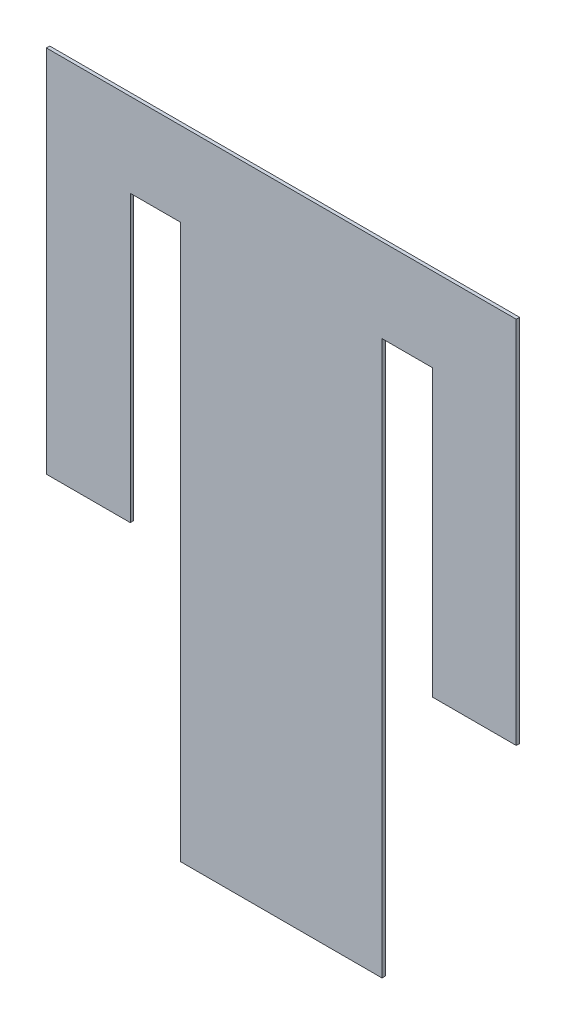
ISO-10303-21;
HEADER;
FILE_DESCRIPTION(('STEP AP214'),'2;1');
FILE_NAME('part.step','',(''),(''),'','','');
FILE_SCHEMA(('AUTOMOTIVE_DESIGN { 1 0 10303 214 1 1 1 1 }'));
ENDSEC;
DATA;
#1=APPLICATION_CONTEXT('core data for automotive mechanical design processes');
#2=APPLICATION_PROTOCOL_DEFINITION('international standard','automotive_design',2000,#1);
#3=PRODUCT_CONTEXT('',#1,'mechanical');
#4=PRODUCT('Part','Part','',(#3));
#5=PRODUCT_RELATED_PRODUCT_CATEGORY('part','',(#4));
#6=PRODUCT_DEFINITION_FORMATION('','',#4);
#7=PRODUCT_DEFINITION_CONTEXT('part definition',#1,'design');
#8=PRODUCT_DEFINITION('design','',#6,#7);
#9=PRODUCT_DEFINITION_SHAPE('','',#8);
#10=(LENGTH_UNIT() NAMED_UNIT(*) SI_UNIT(.MILLI.,.METRE.));
#11=(NAMED_UNIT(*) PLANE_ANGLE_UNIT() SI_UNIT($,.RADIAN.));
#12=(NAMED_UNIT(*) SI_UNIT($,.STERADIAN.) SOLID_ANGLE_UNIT());
#13=UNCERTAINTY_MEASURE_WITH_UNIT(LENGTH_MEASURE(1.E-05),#10,'distance_accuracy_value','');
#14=(GEOMETRIC_REPRESENTATION_CONTEXT(3) GLOBAL_UNCERTAINTY_ASSIGNED_CONTEXT((#13)) GLOBAL_UNIT_ASSIGNED_CONTEXT((#10,
#11,#12)) REPRESENTATION_CONTEXT('',''));
#15=CARTESIAN_POINT('',(0.,0.,0.));
#16=DIRECTION('',(0.,0.,1.));
#17=DIRECTION('',(1.,0.,0.));
#18=AXIS2_PLACEMENT_3D('',#15,#16,#17);
#19=CARTESIAN_POINT('',(50.,0.,2.));
#20=DIRECTION('',(0.,1.,0.));
#21=DIRECTION('',(-1.,0.,0.));
#22=AXIS2_PLACEMENT_3D('',#19,#20,#21);
#23=PLANE('',#22);
#24=DIRECTION('',(1.,0.,0.));
#25=VECTOR('',#24,1.);
#26=CARTESIAN_POINT('',(50.,0.,0.));
#27=LINE('',#26,#25);
#28=CARTESIAN_POINT('',(0.,0.,0.));
#29=VERTEX_POINT('',#28);
#30=CARTESIAN_POINT('',(50.,0.,0.));
#31=VERTEX_POINT('',#30);
#32=EDGE_CURVE('E164',#29,#31,#27,.T.);
#33=ORIENTED_EDGE('',*,*,#32,.T.);
#34=DIRECTION('',(0.,0.,-1.));
#35=VECTOR('',#34,1.);
#36=CARTESIAN_POINT('',(50.,0.,2.));
#37=LINE('',#36,#35);
#38=CARTESIAN_POINT('',(50.,0.,2.));
#39=VERTEX_POINT('',#38);
#40=EDGE_CURVE('E11',#39,#31,#37,.T.);
#41=ORIENTED_EDGE('',*,*,#40,.F.);
#42=DIRECTION('',(1.,0.,0.));
#43=VECTOR('',#42,1.);
#44=CARTESIAN_POINT('',(50.,0.,2.));
#45=LINE('',#44,#43);
#46=CARTESIAN_POINT('',(0.,0.,2.));
#47=VERTEX_POINT('',#46);
#48=EDGE_CURVE('E198',#47,#39,#45,.T.);
#49=ORIENTED_EDGE('',*,*,#48,.F.);
#50=DIRECTION('',(0.,0.,-1.));
#51=VECTOR('',#50,1.);
#52=CARTESIAN_POINT('',(0.,0.,2.));
#53=LINE('',#52,#51);
#54=EDGE_CURVE('E160',#47,#29,#53,.T.);
#55=ORIENTED_EDGE('',*,*,#54,.T.);
#56=EDGE_LOOP('',(#33,#41,#49,#55));
#57=FACE_BOUND('',#56,.T.);
#58=ADVANCED_FACE('F39',(#57),#23,.F.);
#59=CARTESIAN_POINT('',(50.,170.,2.));
#60=DIRECTION('',(-1.,0.,0.));
#61=DIRECTION('',(0.,-1.,0.));
#62=AXIS2_PLACEMENT_3D('',#59,#60,#61);
#63=PLANE('',#62);
#64=DIRECTION('',(0.,1.,0.));
#65=VECTOR('',#64,1.);
#66=CARTESIAN_POINT('',(50.,170.,0.));
#67=LINE('',#66,#65);
#68=CARTESIAN_POINT('',(50.,170.,0.));
#69=VERTEX_POINT('',#68);
#70=EDGE_CURVE('E168',#31,#69,#67,.T.);
#71=ORIENTED_EDGE('',*,*,#70,.T.);
#72=DIRECTION('',(0.,0.,-1.));
#73=VECTOR('',#72,1.);
#74=CARTESIAN_POINT('',(50.,170.,2.));
#75=LINE('',#74,#73);
#76=CARTESIAN_POINT('',(50.,170.,2.));
#77=VERTEX_POINT('',#76);
#78=EDGE_CURVE('E48',#77,#69,#75,.T.);
#79=ORIENTED_EDGE('',*,*,#78,.F.);
#80=DIRECTION('',(0.,1.,0.));
#81=VECTOR('',#80,1.);
#82=CARTESIAN_POINT('',(50.,170.,2.));
#83=LINE('',#82,#81);
#84=EDGE_CURVE('E111',#39,#77,#83,.T.);
#85=ORIENTED_EDGE('',*,*,#84,.F.);
#86=ORIENTED_EDGE('',*,*,#40,.T.);
#87=EDGE_LOOP('',(#71,#79,#85,#86));
#88=FACE_BOUND('',#87,.T.);
#89=ADVANCED_FACE('F292',(#88),#63,.F.);
#90=CARTESIAN_POINT('',(80.,170.,2.));
#91=DIRECTION('',(0.,1.,0.));
#92=DIRECTION('',(0.,0.,1.));
#93=AXIS2_PLACEMENT_3D('',#90,#91,#92);
#94=PLANE('',#93);
#95=DIRECTION('',(1.,0.,0.));
#96=VECTOR('',#95,1.);
#97=CARTESIAN_POINT('',(80.,170.,0.));
#98=LINE('',#97,#96);
#99=CARTESIAN_POINT('',(80.,170.,0.));
#100=VERTEX_POINT('',#99);
#101=EDGE_CURVE('E171',#69,#100,#98,.T.);
#102=ORIENTED_EDGE('',*,*,#101,.T.);
#103=DIRECTION('',(0.,0.,-1.));
#104=VECTOR('',#103,1.);
#105=CARTESIAN_POINT('',(80.,170.,2.));
#106=LINE('',#105,#104);
#107=CARTESIAN_POINT('',(80.,170.,2.));
#108=VERTEX_POINT('',#107);
#109=EDGE_CURVE('E225',#108,#100,#106,.T.);
#110=ORIENTED_EDGE('',*,*,#109,.F.);
#111=DIRECTION('',(1.,0.,0.));
#112=VECTOR('',#111,1.);
#113=CARTESIAN_POINT('',(80.,170.,2.));
#114=LINE('',#113,#112);
#115=EDGE_CURVE('E235',#77,#108,#114,.T.);
#116=ORIENTED_EDGE('',*,*,#115,.F.);
#117=ORIENTED_EDGE('',*,*,#78,.T.);
#118=EDGE_LOOP('',(#102,#110,#116,#117));
#119=FACE_BOUND('',#118,.T.);
#120=ADVANCED_FACE('F233',(#119),#94,.F.);
#121=CARTESIAN_POINT('',(80.,-160.,2.));
#122=DIRECTION('',(1.,0.,0.));
#123=DIRECTION('',(0.,0.,-1.));
#124=AXIS2_PLACEMENT_3D('',#121,#122,#123);
#125=PLANE('',#124);
#126=DIRECTION('',(0.,-1.,0.));
#127=VECTOR('',#126,1.);
#128=CARTESIAN_POINT('',(80.,-160.,0.));
#129=LINE('',#128,#127);
#130=CARTESIAN_POINT('',(80.,-160.,0.));
#131=VERTEX_POINT('',#130);
#132=EDGE_CURVE('E174',#100,#131,#129,.T.);
#133=ORIENTED_EDGE('',*,*,#132,.T.);
#134=DIRECTION('',(0.,0.,-1.));
#135=VECTOR('',#134,1.);
#136=CARTESIAN_POINT('',(80.,-160.,2.));
#137=LINE('',#136,#135);
#138=CARTESIAN_POINT('',(80.,-160.,2.));
#139=VERTEX_POINT('',#138);
#140=EDGE_CURVE('E221',#139,#131,#137,.T.);
#141=ORIENTED_EDGE('',*,*,#140,.F.);
#142=DIRECTION('',(0.,-1.,0.));
#143=VECTOR('',#142,1.);
#144=CARTESIAN_POINT('',(80.,-160.,2.));
#145=LINE('',#144,#143);
#146=EDGE_CURVE('E254',#108,#139,#145,.T.);
#147=ORIENTED_EDGE('',*,*,#146,.F.);
#148=ORIENTED_EDGE('',*,*,#109,.T.);
#149=EDGE_LOOP('',(#133,#141,#147,#148));
#150=FACE_BOUND('',#149,.T.);
#151=ADVANCED_FACE('F244',(#150),#125,.F.);
#152=CARTESIAN_POINT('',(200.,-160.,2.));
#153=DIRECTION('',(0.,1.,0.));
#154=DIRECTION('',(-1.,0.,0.));
#155=AXIS2_PLACEMENT_3D('',#152,#153,#154);
#156=PLANE('',#155);
#157=DIRECTION('',(1.,0.,0.));
#158=VECTOR('',#157,1.);
#159=CARTESIAN_POINT('',(200.,-160.,0.));
#160=LINE('',#159,#158);
#161=CARTESIAN_POINT('',(200.,-160.,0.));
#162=VERTEX_POINT('',#161);
#163=EDGE_CURVE('E177',#131,#162,#160,.T.);
#164=ORIENTED_EDGE('',*,*,#163,.T.);
#165=DIRECTION('',(0.,0.,-1.));
#166=VECTOR('',#165,1.);
#167=CARTESIAN_POINT('',(200.,-160.,2.));
#168=LINE('',#167,#166);
#169=CARTESIAN_POINT('',(200.,-160.,2.));
#170=VERTEX_POINT('',#169);
#171=EDGE_CURVE('E217',#170,#162,#168,.T.);
#172=ORIENTED_EDGE('',*,*,#171,.F.);
#173=DIRECTION('',(1.,0.,0.));
#174=VECTOR('',#173,1.);
#175=CARTESIAN_POINT('',(200.,-160.,2.));
#176=LINE('',#175,#174);
#177=EDGE_CURVE('E250',#139,#170,#176,.T.);
#178=ORIENTED_EDGE('',*,*,#177,.F.);
#179=ORIENTED_EDGE('',*,*,#140,.T.);
#180=EDGE_LOOP('',(#164,#172,#178,#179));
#181=FACE_BOUND('',#180,.T.);
#182=ADVANCED_FACE('F248',(#181),#156,.F.);
#183=CARTESIAN_POINT('',(200.,170.,2.));
#184=DIRECTION('',(-1.,0.,0.));
#185=DIRECTION('',(0.,-1.,0.));
#186=AXIS2_PLACEMENT_3D('',#183,#184,#185);
#187=PLANE('',#186);
#188=DIRECTION('',(0.,1.,0.));
#189=VECTOR('',#188,1.);
#190=CARTESIAN_POINT('',(200.,170.,0.));
#191=LINE('',#190,#189);
#192=CARTESIAN_POINT('',(200.,170.,0.));
#193=VERTEX_POINT('',#192);
#194=EDGE_CURVE('E180',#162,#193,#191,.T.);
#195=ORIENTED_EDGE('',*,*,#194,.T.);
#196=DIRECTION('',(0.,0.,-1.));
#197=VECTOR('',#196,1.);
#198=CARTESIAN_POINT('',(200.,170.,2.));
#199=LINE('',#198,#197);
#200=CARTESIAN_POINT('',(200.,170.,2.));
#201=VERTEX_POINT('',#200);
#202=EDGE_CURVE('E213',#201,#193,#199,.T.);
#203=ORIENTED_EDGE('',*,*,#202,.F.);
#204=DIRECTION('',(0.,1.,0.));
#205=VECTOR('',#204,1.);
#206=CARTESIAN_POINT('',(200.,170.,2.));
#207=LINE('',#206,#205);
#208=EDGE_CURVE('E253',#170,#201,#207,.T.);
#209=ORIENTED_EDGE('',*,*,#208,.F.);
#210=ORIENTED_EDGE('',*,*,#171,.T.);
#211=EDGE_LOOP('',(#195,#203,#209,#210));
#212=FACE_BOUND('',#211,.T.);
#213=ADVANCED_FACE('F305',(#212),#187,.F.);
#214=CARTESIAN_POINT('',(230.,170.,2.));
#215=DIRECTION('',(0.,1.,0.));
#216=DIRECTION('',(0.,0.,1.));
#217=AXIS2_PLACEMENT_3D('',#214,#215,#216);
#218=PLANE('',#217);
#219=DIRECTION('',(1.,0.,0.));
#220=VECTOR('',#219,1.);
#221=CARTESIAN_POINT('',(230.,170.,0.));
#222=LINE('',#221,#220);
#223=CARTESIAN_POINT('',(230.,170.,0.));
#224=VERTEX_POINT('',#223);
#225=EDGE_CURVE('E183',#193,#224,#222,.T.);
#226=ORIENTED_EDGE('',*,*,#225,.T.);
#227=DIRECTION('',(0.,0.,-1.));
#228=VECTOR('',#227,1.);
#229=CARTESIAN_POINT('',(230.,170.,2.));
#230=LINE('',#229,#228);
#231=CARTESIAN_POINT('',(230.,170.,2.));
#232=VERTEX_POINT('',#231);
#233=EDGE_CURVE('E209',#232,#224,#230,.T.);
#234=ORIENTED_EDGE('',*,*,#233,.F.);
#235=DIRECTION('',(1.,0.,0.));
#236=VECTOR('',#235,1.);
#237=CARTESIAN_POINT('',(230.,170.,2.));
#238=LINE('',#237,#236);
#239=EDGE_CURVE('E258',#201,#232,#238,.T.);
#240=ORIENTED_EDGE('',*,*,#239,.F.);
#241=ORIENTED_EDGE('',*,*,#202,.T.);
#242=EDGE_LOOP('',(#226,#234,#240,#241));
#243=FACE_BOUND('',#242,.T.);
#244=ADVANCED_FACE('F308',(#243),#218,.F.);
#245=CARTESIAN_POINT('',(230.,0.,2.));
#246=DIRECTION('',(1.,0.,0.));
#247=DIRECTION('',(0.,0.,-1.));
#248=AXIS2_PLACEMENT_3D('',#245,#246,#247);
#249=PLANE('',#248);
#250=DIRECTION('',(0.,-1.,0.));
#251=VECTOR('',#250,1.);
#252=CARTESIAN_POINT('',(230.,0.,0.));
#253=LINE('',#252,#251);
#254=CARTESIAN_POINT('',(230.,0.,0.));
#255=VERTEX_POINT('',#254);
#256=EDGE_CURVE('E186',#224,#255,#253,.T.);
#257=ORIENTED_EDGE('',*,*,#256,.T.);
#258=DIRECTION('',(0.,0.,-1.));
#259=VECTOR('',#258,1.);
#260=CARTESIAN_POINT('',(230.,0.,2.));
#261=LINE('',#260,#259);
#262=CARTESIAN_POINT('',(230.,0.,2.));
#263=VERTEX_POINT('',#262);
#264=EDGE_CURVE('E205',#263,#255,#261,.T.);
#265=ORIENTED_EDGE('',*,*,#264,.F.);
#266=DIRECTION('',(0.,-1.,0.));
#267=VECTOR('',#266,1.);
#268=CARTESIAN_POINT('',(230.,0.,2.));
#269=LINE('',#268,#267);
#270=EDGE_CURVE('E265',#232,#263,#269,.T.);
#271=ORIENTED_EDGE('',*,*,#270,.F.);
#272=ORIENTED_EDGE('',*,*,#233,.T.);
#273=EDGE_LOOP('',(#257,#265,#271,#272));
#274=FACE_BOUND('',#273,.T.);
#275=ADVANCED_FACE('F273',(#274),#249,.F.);
#276=CARTESIAN_POINT('',(280.,0.,2.));
#277=DIRECTION('',(0.,1.,0.));
#278=DIRECTION('',(-1.,0.,0.));
#279=AXIS2_PLACEMENT_3D('',#276,#277,#278);
#280=PLANE('',#279);
#281=DIRECTION('',(1.,0.,0.));
#282=VECTOR('',#281,1.);
#283=CARTESIAN_POINT('',(280.,0.,0.));
#284=LINE('',#283,#282);
#285=CARTESIAN_POINT('',(280.,0.,0.));
#286=VERTEX_POINT('',#285);
#287=EDGE_CURVE('E189',#255,#286,#284,.T.);
#288=ORIENTED_EDGE('',*,*,#287,.T.);
#289=DIRECTION('',(0.,0.,-1.));
#290=VECTOR('',#289,1.);
#291=CARTESIAN_POINT('',(280.,0.,2.));
#292=LINE('',#291,#290);
#293=CARTESIAN_POINT('',(280.,0.,2.));
#294=VERTEX_POINT('',#293);
#295=EDGE_CURVE('E153',#294,#286,#292,.T.);
#296=ORIENTED_EDGE('',*,*,#295,.F.);
#297=DIRECTION('',(1.,0.,0.));
#298=VECTOR('',#297,1.);
#299=CARTESIAN_POINT('',(280.,0.,2.));
#300=LINE('',#299,#298);
#301=EDGE_CURVE('E142',#263,#294,#300,.T.);
#302=ORIENTED_EDGE('',*,*,#301,.F.);
#303=ORIENTED_EDGE('',*,*,#264,.T.);
#304=EDGE_LOOP('',(#288,#296,#302,#303));
#305=FACE_BOUND('',#304,.T.);
#306=ADVANCED_FACE('F277',(#305),#280,.F.);
#307=CARTESIAN_POINT('',(280.,220.,2.));
#308=DIRECTION('',(-1.,0.,0.));
#309=DIRECTION('',(0.,0.,1.));
#310=AXIS2_PLACEMENT_3D('',#307,#308,#309);
#311=PLANE('',#310);
#312=DIRECTION('',(0.,1.,0.));
#313=VECTOR('',#312,1.);
#314=CARTESIAN_POINT('',(280.,220.,0.));
#315=LINE('',#314,#313);
#316=CARTESIAN_POINT('',(280.,220.,0.));
#317=VERTEX_POINT('',#316);
#318=EDGE_CURVE('E151',#286,#317,#315,.T.);
#319=ORIENTED_EDGE('',*,*,#318,.T.);
#320=DIRECTION('',(0.,0.,-1.));
#321=VECTOR('',#320,1.);
#322=CARTESIAN_POINT('',(280.,220.,2.));
#323=LINE('',#322,#321);
#324=CARTESIAN_POINT('',(280.,220.,2.));
#325=VERTEX_POINT('',#324);
#326=EDGE_CURVE('E148',#325,#317,#323,.T.);
#327=ORIENTED_EDGE('',*,*,#326,.F.);
#328=DIRECTION('',(0.,1.,0.));
#329=VECTOR('',#328,1.);
#330=CARTESIAN_POINT('',(280.,220.,2.));
#331=LINE('',#330,#329);
#332=EDGE_CURVE('E136',#294,#325,#331,.T.);
#333=ORIENTED_EDGE('',*,*,#332,.F.);
#334=ORIENTED_EDGE('',*,*,#295,.T.);
#335=EDGE_LOOP('',(#319,#327,#333,#334));
#336=FACE_BOUND('',#335,.T.);
#337=ADVANCED_FACE('F149',(#336),#311,.F.);
#338=CARTESIAN_POINT('',(0.,220.,2.));
#339=DIRECTION('',(0.,-1.,0.));
#340=DIRECTION('',(1.,0.,0.));
#341=AXIS2_PLACEMENT_3D('',#338,#339,#340);
#342=PLANE('',#341);
#343=DIRECTION('',(-1.,0.,0.));
#344=VECTOR('',#343,1.);
#345=CARTESIAN_POINT('',(0.,220.,0.));
#346=LINE('',#345,#344);
#347=CARTESIAN_POINT('',(0.,220.,0.));
#348=VERTEX_POINT('',#347);
#349=EDGE_CURVE('E97',#317,#348,#346,.T.);
#350=ORIENTED_EDGE('',*,*,#349,.T.);
#351=DIRECTION('',(0.,0.,-1.));
#352=VECTOR('',#351,1.);
#353=CARTESIAN_POINT('',(0.,220.,2.));
#354=LINE('',#353,#352);
#355=CARTESIAN_POINT('',(0.,220.,2.));
#356=VERTEX_POINT('',#355);
#357=EDGE_CURVE('E154',#356,#348,#354,.T.);
#358=ORIENTED_EDGE('',*,*,#357,.F.);
#359=DIRECTION('',(-1.,0.,0.));
#360=VECTOR('',#359,1.);
#361=CARTESIAN_POINT('',(0.,220.,2.));
#362=LINE('',#361,#360);
#363=EDGE_CURVE('E140',#325,#356,#362,.T.);
#364=ORIENTED_EDGE('',*,*,#363,.F.);
#365=ORIENTED_EDGE('',*,*,#326,.T.);
#366=EDGE_LOOP('',(#350,#358,#364,#365));
#367=FACE_BOUND('',#366,.T.);
#368=ADVANCED_FACE('F156',(#367),#342,.F.);
#369=CARTESIAN_POINT('',(0.,0.,2.));
#370=DIRECTION('',(1.,0.,0.));
#371=DIRECTION('',(0.,0.,-1.));
#372=AXIS2_PLACEMENT_3D('',#369,#370,#371);
#373=PLANE('',#372);
#374=DIRECTION('',(0.,-1.,0.));
#375=VECTOR('',#374,1.);
#376=CARTESIAN_POINT('',(0.,0.,0.));
#377=LINE('',#376,#375);
#378=EDGE_CURVE('E103',#348,#29,#377,.T.);
#379=ORIENTED_EDGE('',*,*,#378,.T.);
#380=ORIENTED_EDGE('',*,*,#54,.F.);
#381=DIRECTION('',(0.,-1.,0.));
#382=VECTOR('',#381,1.);
#383=CARTESIAN_POINT('',(0.,0.,2.));
#384=LINE('',#383,#382);
#385=EDGE_CURVE('E56',#356,#47,#384,.T.);
#386=ORIENTED_EDGE('',*,*,#385,.F.);
#387=ORIENTED_EDGE('',*,*,#357,.T.);
#388=EDGE_LOOP('',(#379,#380,#386,#387));
#389=FACE_BOUND('',#388,.T.);
#390=ADVANCED_FACE('F281',(#389),#373,.F.);
#391=CARTESIAN_POINT('',(0.,0.,2.));
#392=DIRECTION('',(0.,0.,-1.));
#393=DIRECTION('',(-1.,0.,0.));
#394=AXIS2_PLACEMENT_3D('',#391,#392,#393);
#395=PLANE('',#394);
#396=ORIENTED_EDGE('',*,*,#48,.T.);
#397=ORIENTED_EDGE('',*,*,#84,.T.);
#398=ORIENTED_EDGE('',*,*,#115,.T.);
#399=ORIENTED_EDGE('',*,*,#146,.T.);
#400=ORIENTED_EDGE('',*,*,#177,.T.);
#401=ORIENTED_EDGE('',*,*,#208,.T.);
#402=ORIENTED_EDGE('',*,*,#239,.T.);
#403=ORIENTED_EDGE('',*,*,#270,.T.);
#404=ORIENTED_EDGE('',*,*,#301,.T.);
#405=ORIENTED_EDGE('',*,*,#332,.T.);
#406=ORIENTED_EDGE('',*,*,#363,.T.);
#407=ORIENTED_EDGE('',*,*,#385,.T.);
#408=EDGE_LOOP('',(#396,#397,#398,#399,#400,#401,#402,#403,#404,#405,#406,#407));
#409=FACE_BOUND('',#408,.T.);
#410=ADVANCED_FACE('F138',(#409),#395,.F.);
#411=CARTESIAN_POINT('',(0.,0.,0.));
#412=DIRECTION('',(0.,0.,-1.));
#413=DIRECTION('',(-1.,0.,0.));
#414=AXIS2_PLACEMENT_3D('',#411,#412,#413);
#415=PLANE('',#414);
#416=ORIENTED_EDGE('',*,*,#32,.F.);
#417=ORIENTED_EDGE('',*,*,#378,.F.);
#418=ORIENTED_EDGE('',*,*,#349,.F.);
#419=ORIENTED_EDGE('',*,*,#318,.F.);
#420=ORIENTED_EDGE('',*,*,#287,.F.);
#421=ORIENTED_EDGE('',*,*,#256,.F.);
#422=ORIENTED_EDGE('',*,*,#225,.F.);
#423=ORIENTED_EDGE('',*,*,#194,.F.);
#424=ORIENTED_EDGE('',*,*,#163,.F.);
#425=ORIENTED_EDGE('',*,*,#132,.F.);
#426=ORIENTED_EDGE('',*,*,#101,.F.);
#427=ORIENTED_EDGE('',*,*,#70,.F.);
#428=EDGE_LOOP('',(#416,#417,#418,#419,#420,#421,#422,#423,#424,#425,#426,#427));
#429=FACE_BOUND('',#428,.T.);
#430=ADVANCED_FACE('F239',(#429),#415,.T.);
#431=CLOSED_SHELL('',(#58,#89,#120,#151,#182,#213,#244,#275,#306,#337,#368,#390,#410,#430));
#432=MANIFOLD_SOLID_BREP('B2',#431);
#433=ADVANCED_BREP_SHAPE_REPRESENTATION('',(#18,#432),#14);
#434=SHAPE_DEFINITION_REPRESENTATION(#9,#433);
ENDSEC;
END-ISO-10303-21;
